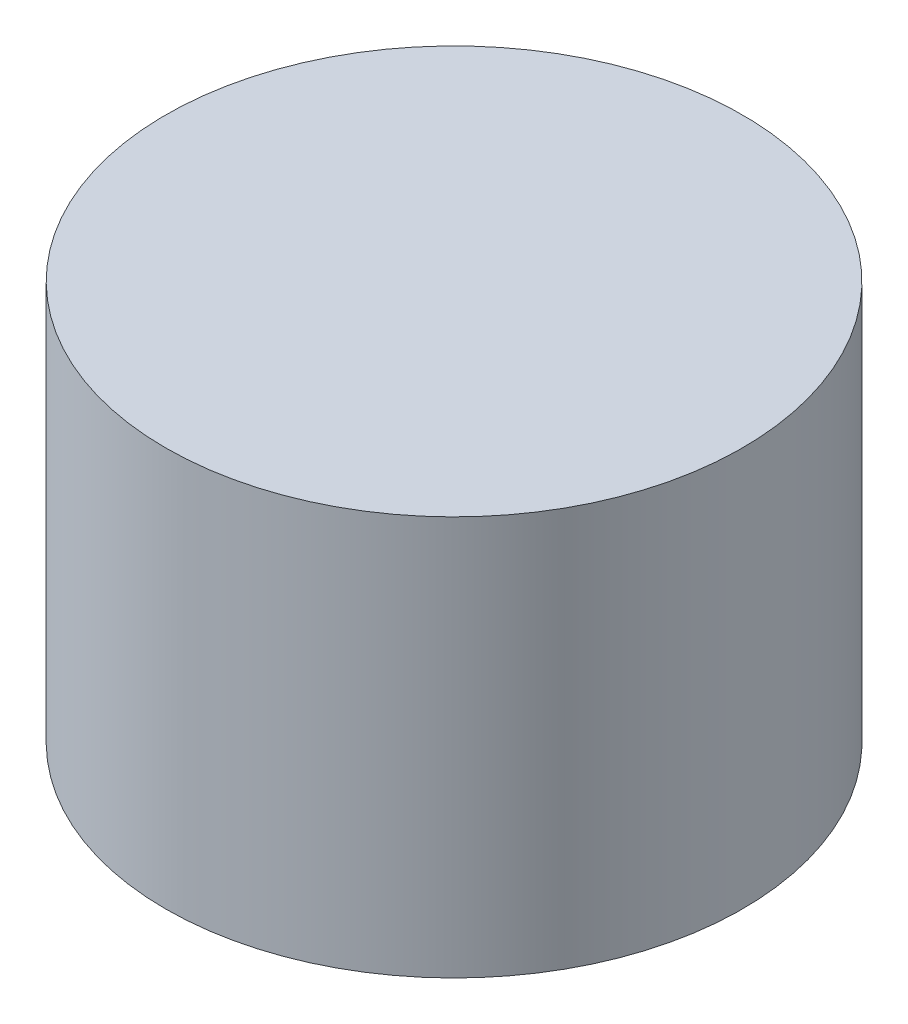
ISO-10303-21;
HEADER;
FILE_DESCRIPTION(('STEP AP214'),'2;1');
FILE_NAME('part.step','',(''),(''),'','','');
FILE_SCHEMA(('AUTOMOTIVE_DESIGN { 1 0 10303 214 1 1 1 1 }'));
ENDSEC;
DATA;
#1=APPLICATION_CONTEXT('core data for automotive mechanical design processes');
#2=APPLICATION_PROTOCOL_DEFINITION('international standard','automotive_design',2000,#1);
#3=PRODUCT_CONTEXT('',#1,'mechanical');
#4=PRODUCT('Part','Part','',(#3));
#5=PRODUCT_RELATED_PRODUCT_CATEGORY('part','',(#4));
#6=PRODUCT_DEFINITION_FORMATION('','',#4);
#7=PRODUCT_DEFINITION_CONTEXT('part definition',#1,'design');
#8=PRODUCT_DEFINITION('design','',#6,#7);
#9=PRODUCT_DEFINITION_SHAPE('','',#8);
#10=(LENGTH_UNIT() NAMED_UNIT(*) SI_UNIT(.MILLI.,.METRE.));
#11=(NAMED_UNIT(*) PLANE_ANGLE_UNIT() SI_UNIT($,.RADIAN.));
#12=(NAMED_UNIT(*) SI_UNIT($,.STERADIAN.) SOLID_ANGLE_UNIT());
#13=UNCERTAINTY_MEASURE_WITH_UNIT(LENGTH_MEASURE(1.E-05),#10,'distance_accuracy_value','');
#14=(GEOMETRIC_REPRESENTATION_CONTEXT(3) GLOBAL_UNCERTAINTY_ASSIGNED_CONTEXT((#13)) GLOBAL_UNIT_ASSIGNED_CONTEXT((#10,
#11,#12)) REPRESENTATION_CONTEXT('',''));
#15=CARTESIAN_POINT('',(0.,0.,0.));
#16=DIRECTION('',(0.,0.,1.));
#17=DIRECTION('',(1.,0.,0.));
#18=AXIS2_PLACEMENT_3D('',#15,#16,#17);
#19=CARTESIAN_POINT('',(0.,18.,0.));
#20=DIRECTION('',(0.,-1.,0.));
#21=DIRECTION('',(0.,0.,-1.));
#22=AXIS2_PLACEMENT_3D('',#19,#20,#21);
#23=CYLINDRICAL_SURFACE('',#22,13.);
#24=CARTESIAN_POINT('',(0.,18.,0.));
#25=DIRECTION('',(0.,1.,0.));
#26=DIRECTION('',(0.,0.,1.));
#27=AXIS2_PLACEMENT_3D('',#24,#25,#26);
#28=CIRCLE('',#27,13.);
#29=CARTESIAN_POINT('',(0.,18.,13.));
#30=VERTEX_POINT('',#29);
#31=EDGE_CURVE('E10',#30,#30,#28,.T.);
#32=ORIENTED_EDGE('',*,*,#31,.F.);
#33=EDGE_LOOP('',(#32));
#34=FACE_BOUND('',#33,.T.);
#35=CARTESIAN_POINT('',(0.,0.,0.));
#36=DIRECTION('',(0.,1.,0.));
#37=DIRECTION('',(0.,0.,1.));
#38=AXIS2_PLACEMENT_3D('',#35,#36,#37);
#39=CIRCLE('',#38,13.);
#40=CARTESIAN_POINT('',(0.,0.,13.));
#41=VERTEX_POINT('',#40);
#42=EDGE_CURVE('E35',#41,#41,#39,.T.);
#43=ORIENTED_EDGE('',*,*,#42,.T.);
#44=EDGE_LOOP('',(#43));
#45=FACE_BOUND('',#44,.T.);
#46=ADVANCED_FACE('F32',(#34,#45),#23,.T.);
#47=CARTESIAN_POINT('',(0.,18.,0.));
#48=DIRECTION('',(0.,1.,0.));
#49=DIRECTION('',(0.,0.,1.));
#50=AXIS2_PLACEMENT_3D('',#47,#48,#49);
#51=PLANE('',#50);
#52=ORIENTED_EDGE('',*,*,#31,.T.);
#53=EDGE_LOOP('',(#52));
#54=FACE_BOUND('',#53,.T.);
#55=ADVANCED_FACE('F47',(#54),#51,.T.);
#56=CARTESIAN_POINT('',(0.,0.,0.));
#57=DIRECTION('',(0.,1.,0.));
#58=DIRECTION('',(0.,0.,1.));
#59=AXIS2_PLACEMENT_3D('',#56,#57,#58);
#60=PLANE('',#59);
#61=ORIENTED_EDGE('',*,*,#42,.F.);
#62=EDGE_LOOP('',(#61));
#63=FACE_BOUND('',#62,.T.);
#64=ADVANCED_FACE('F45',(#63),#60,.F.);
#65=CLOSED_SHELL('',(#46,#55,#64));
#66=MANIFOLD_SOLID_BREP('B2',#65);
#67=ADVANCED_BREP_SHAPE_REPRESENTATION('',(#18,#66),#14);
#68=SHAPE_DEFINITION_REPRESENTATION(#9,#67);
ENDSEC;
END-ISO-10303-21;
